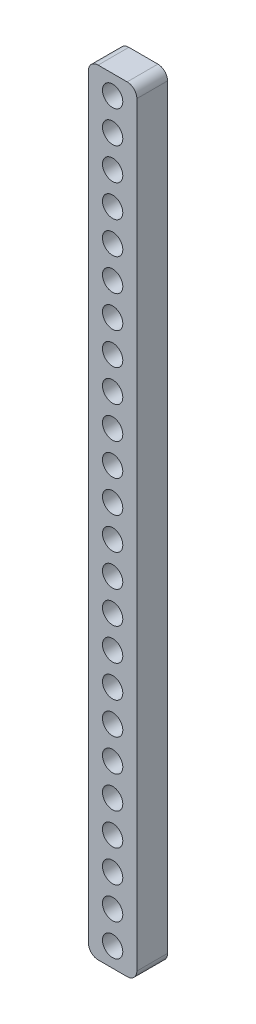
ISO-10303-21;
HEADER;
FILE_DESCRIPTION(('STEP AP214'),'2;1');
FILE_NAME('part.step','',(''),(''),'','','');
FILE_SCHEMA(('AUTOMOTIVE_DESIGN { 1 0 10303 214 1 1 1 1 }'));
ENDSEC;
DATA;
#1=APPLICATION_CONTEXT('core data for automotive mechanical design processes');
#2=APPLICATION_PROTOCOL_DEFINITION('international standard','automotive_design',2000,#1);
#3=PRODUCT_CONTEXT('',#1,'mechanical');
#4=PRODUCT('Part','Part','',(#3));
#5=PRODUCT_RELATED_PRODUCT_CATEGORY('part','',(#4));
#6=PRODUCT_DEFINITION_FORMATION('','',#4);
#7=PRODUCT_DEFINITION_CONTEXT('part definition',#1,'design');
#8=PRODUCT_DEFINITION('design','',#6,#7);
#9=PRODUCT_DEFINITION_SHAPE('','',#8);
#10=(LENGTH_UNIT() NAMED_UNIT(*) SI_UNIT(.MILLI.,.METRE.));
#11=(NAMED_UNIT(*) PLANE_ANGLE_UNIT() SI_UNIT($,.RADIAN.));
#12=(NAMED_UNIT(*) SI_UNIT($,.STERADIAN.) SOLID_ANGLE_UNIT());
#13=UNCERTAINTY_MEASURE_WITH_UNIT(LENGTH_MEASURE(1.E-05),#10,'distance_accuracy_value','');
#14=(GEOMETRIC_REPRESENTATION_CONTEXT(3) GLOBAL_UNCERTAINTY_ASSIGNED_CONTEXT((#13)) GLOBAL_UNIT_ASSIGNED_CONTEXT((#10,
#11,#12)) REPRESENTATION_CONTEXT('',''));
#15=CARTESIAN_POINT('',(0.,0.,0.));
#16=DIRECTION('',(0.,0.,1.));
#17=DIRECTION('',(1.,0.,0.));
#18=AXIS2_PLACEMENT_3D('',#15,#16,#17);
#19=CARTESIAN_POINT('',(-2.99999999999997,-78.,6.35));
#20=DIRECTION('',(0.,0.,-1.));
#21=DIRECTION('',(-1.,0.,0.));
#22=AXIS2_PLACEMENT_3D('',#19,#20,#21);
#23=PLANE('',#22);
#24=CARTESIAN_POINT('',(-2.99999999999997,-78.,6.35));
#25=DIRECTION('',(0.,0.,1.));
#26=DIRECTION('',(-1.,0.,0.));
#27=AXIS2_PLACEMENT_3D('',#24,#25,#26);
#28=CIRCLE('',#27,2.);
#29=CARTESIAN_POINT('',(-4.99999999999997,-78.,6.35));
#30=VERTEX_POINT('',#29);
#31=CARTESIAN_POINT('',(-2.99999999999996,-80.,6.35));
#32=VERTEX_POINT('',#31);
#33=EDGE_CURVE('E164',#30,#32,#28,.T.);
#34=ORIENTED_EDGE('',*,*,#33,.T.);
#35=DIRECTION('',(1.,0.,0.));
#36=VECTOR('',#35,1.);
#37=CARTESIAN_POINT('',(2.99999999999995,-80.,6.35));
#38=LINE('',#37,#36);
#39=CARTESIAN_POINT('',(2.99999999999995,-80.,6.35));
#40=VERTEX_POINT('',#39);
#41=EDGE_CURVE('E100',#32,#40,#38,.T.);
#42=ORIENTED_EDGE('',*,*,#41,.T.);
#43=CARTESIAN_POINT('',(2.99999999999997,-78.,6.35));
#44=DIRECTION('',(0.,0.,1.));
#45=DIRECTION('',(1.,0.,0.));
#46=AXIS2_PLACEMENT_3D('',#43,#44,#45);
#47=CIRCLE('',#46,2.);
#48=CARTESIAN_POINT('',(4.99999999999997,-78.,6.35));
#49=VERTEX_POINT('',#48);
#50=EDGE_CURVE('E185',#40,#49,#47,.T.);
#51=ORIENTED_EDGE('',*,*,#50,.T.);
#52=DIRECTION('',(0.,1.,0.));
#53=VECTOR('',#52,1.);
#54=CARTESIAN_POINT('',(4.99999999999997,-78.,6.35));
#55=LINE('',#54,#53);
#56=CARTESIAN_POINT('',(4.99999999999997,78.,6.35));
#57=VERTEX_POINT('',#56);
#58=EDGE_CURVE('E199',#49,#57,#55,.T.);
#59=ORIENTED_EDGE('',*,*,#58,.T.);
#60=CARTESIAN_POINT('',(2.99999999999997,78.,6.35));
#61=DIRECTION('',(0.,0.,1.));
#62=DIRECTION('',(1.,0.,0.));
#63=AXIS2_PLACEMENT_3D('',#60,#61,#62);
#64=CIRCLE('',#63,2.);
#65=CARTESIAN_POINT('',(2.99999999999996,80.,6.35));
#66=VERTEX_POINT('',#65);
#67=EDGE_CURVE('E119',#57,#66,#64,.T.);
#68=ORIENTED_EDGE('',*,*,#67,.T.);
#69=DIRECTION('',(-1.,0.,0.));
#70=VECTOR('',#69,1.);
#71=CARTESIAN_POINT('',(2.99999999999995,80.,6.35));
#72=LINE('',#71,#70);
#73=CARTESIAN_POINT('',(-3.00000000000002,80.,6.35));
#74=VERTEX_POINT('',#73);
#75=EDGE_CURVE('E113',#66,#74,#72,.T.);
#76=ORIENTED_EDGE('',*,*,#75,.T.);
#77=CARTESIAN_POINT('',(-3.00000000000003,78.,6.35));
#78=DIRECTION('',(0.,0.,1.));
#79=DIRECTION('',(1.,0.,0.));
#80=AXIS2_PLACEMENT_3D('',#77,#78,#79);
#81=CIRCLE('',#80,2.);
#82=CARTESIAN_POINT('',(-5.00000000000003,78.,6.35));
#83=VERTEX_POINT('',#82);
#84=EDGE_CURVE('E117',#74,#83,#81,.T.);
#85=ORIENTED_EDGE('',*,*,#84,.T.);
#86=DIRECTION('',(0.,-1.,0.));
#87=VECTOR('',#86,1.);
#88=CARTESIAN_POINT('',(-4.99999999999997,-78.,6.35));
#89=LINE('',#88,#87);
#90=EDGE_CURVE('E57',#83,#30,#89,.T.);
#91=ORIENTED_EDGE('',*,*,#90,.T.);
#92=EDGE_LOOP('',(#34,#42,#51,#59,#68,#76,#85,#91));
#93=FACE_BOUND('',#92,.T.);
#94=CARTESIAN_POINT('',(0.,76.,6.35));
#95=DIRECTION('',(0.,0.,1.));
#96=DIRECTION('',(1.,0.,0.));
#97=AXIS2_PLACEMENT_3D('',#94,#95,#96);
#98=CIRCLE('',#97,2.09999999999985);
#99=CARTESIAN_POINT('',(2.09999999999985,76.,6.35));
#100=VERTEX_POINT('',#99);
#101=EDGE_CURVE('E146',#100,#100,#98,.T.);
#102=ORIENTED_EDGE('',*,*,#101,.F.);
#103=EDGE_LOOP('',(#102));
#104=FACE_BOUND('',#103,.T.);
#105=CARTESIAN_POINT('',(0.,69.3913043478261,6.35));
#106=DIRECTION('',(0.,0.,1.));
#107=DIRECTION('',(1.,0.,0.));
#108=AXIS2_PLACEMENT_3D('',#105,#106,#107);
#109=CIRCLE('',#108,2.10000000000001);
#110=CARTESIAN_POINT('',(2.10000000000008,69.3913043478261,6.35));
#111=VERTEX_POINT('',#110);
#112=EDGE_CURVE('E213',#111,#111,#109,.T.);
#113=ORIENTED_EDGE('',*,*,#112,.F.);
#114=EDGE_LOOP('',(#113));
#115=FACE_BOUND('',#114,.T.);
#116=CARTESIAN_POINT('',(1.37635493464256E-13,62.7826086956522,6.35));
#117=DIRECTION('',(0.,0.,1.));
#118=DIRECTION('',(1.,0.,0.));
#119=AXIS2_PLACEMENT_3D('',#116,#117,#118);
#120=CIRCLE('',#119,2.10000000000001);
#121=CARTESIAN_POINT('',(2.10000000000014,62.7826086956522,6.35));
#122=VERTEX_POINT('',#121);
#123=EDGE_CURVE('E221',#122,#122,#120,.T.);
#124=ORIENTED_EDGE('',*,*,#123,.F.);
#125=EDGE_LOOP('',(#124));
#126=FACE_BOUND('',#125,.T.);
#127=CARTESIAN_POINT('',(2.06453240196385E-13,56.1739130434783,6.35));
#128=DIRECTION('',(0.,0.,1.));
#129=DIRECTION('',(1.,0.,0.));
#130=AXIS2_PLACEMENT_3D('',#127,#128,#129);
#131=CIRCLE('',#130,2.10000000000001);
#132=CARTESIAN_POINT('',(2.10000000000021,56.1739130434783,6.35));
#133=VERTEX_POINT('',#132);
#134=EDGE_CURVE('E229',#133,#133,#131,.T.);
#135=ORIENTED_EDGE('',*,*,#134,.F.);
#136=EDGE_LOOP('',(#135));
#137=FACE_BOUND('',#136,.T.);
#138=CARTESIAN_POINT('',(2.75270986928513E-13,49.5652173913043,6.35));
#139=DIRECTION('',(0.,0.,1.));
#140=DIRECTION('',(1.,0.,0.));
#141=AXIS2_PLACEMENT_3D('',#138,#139,#140);
#142=CIRCLE('',#141,2.10000000000001);
#143=CARTESIAN_POINT('',(2.10000000000028,49.5652173913043,6.35));
#144=VERTEX_POINT('',#143);
#145=EDGE_CURVE('E237',#144,#144,#142,.T.);
#146=ORIENTED_EDGE('',*,*,#145,.F.);
#147=EDGE_LOOP('',(#146));
#148=FACE_BOUND('',#147,.T.);
#149=CARTESIAN_POINT('',(3.44088733660641E-13,42.9565217391304,6.35));
#150=DIRECTION('',(0.,0.,1.));
#151=DIRECTION('',(1.,0.,0.));
#152=AXIS2_PLACEMENT_3D('',#149,#150,#151);
#153=CIRCLE('',#152,2.10000000000001);
#154=CARTESIAN_POINT('',(2.10000000000035,42.9565217391304,6.35));
#155=VERTEX_POINT('',#154);
#156=EDGE_CURVE('E245',#155,#155,#153,.T.);
#157=ORIENTED_EDGE('',*,*,#156,.F.);
#158=EDGE_LOOP('',(#157));
#159=FACE_BOUND('',#158,.T.);
#160=CARTESIAN_POINT('',(4.12906480392769E-13,36.3478260869565,6.35));
#161=DIRECTION('',(0.,0.,1.));
#162=DIRECTION('',(1.,0.,0.));
#163=AXIS2_PLACEMENT_3D('',#160,#161,#162);
#164=CIRCLE('',#163,2.10000000000001);
#165=CARTESIAN_POINT('',(2.10000000000042,36.3478260869565,6.35));
#166=VERTEX_POINT('',#165);
#167=EDGE_CURVE('E253',#166,#166,#164,.T.);
#168=ORIENTED_EDGE('',*,*,#167,.F.);
#169=EDGE_LOOP('',(#168));
#170=FACE_BOUND('',#169,.T.);
#171=CARTESIAN_POINT('',(4.81724227124897E-13,29.7391304347826,6.35));
#172=DIRECTION('',(0.,0.,1.));
#173=DIRECTION('',(1.,0.,0.));
#174=AXIS2_PLACEMENT_3D('',#171,#172,#173);
#175=CIRCLE('',#174,2.10000000000001);
#176=CARTESIAN_POINT('',(2.10000000000049,29.7391304347826,6.35));
#177=VERTEX_POINT('',#176);
#178=EDGE_CURVE('E261',#177,#177,#175,.T.);
#179=ORIENTED_EDGE('',*,*,#178,.F.);
#180=EDGE_LOOP('',(#179));
#181=FACE_BOUND('',#180,.T.);
#182=CARTESIAN_POINT('',(5.50541973857026E-13,23.1304347826087,6.35));
#183=DIRECTION('',(0.,0.,1.));
#184=DIRECTION('',(1.,0.,0.));
#185=AXIS2_PLACEMENT_3D('',#182,#183,#184);
#186=CIRCLE('',#185,2.1);
#187=CARTESIAN_POINT('',(2.10000000000056,23.1304347826087,6.35));
#188=VERTEX_POINT('',#187);
#189=EDGE_CURVE('E269',#188,#188,#186,.T.);
#190=ORIENTED_EDGE('',*,*,#189,.F.);
#191=EDGE_LOOP('',(#190));
#192=FACE_BOUND('',#191,.T.);
#193=CARTESIAN_POINT('',(6.19359720589154E-13,16.5217391304348,6.35));
#194=DIRECTION('',(0.,0.,1.));
#195=DIRECTION('',(1.,0.,0.));
#196=AXIS2_PLACEMENT_3D('',#193,#194,#195);
#197=CIRCLE('',#196,2.1);
#198=CARTESIAN_POINT('',(2.10000000000062,16.5217391304348,6.35));
#199=VERTEX_POINT('',#198);
#200=EDGE_CURVE('E277',#199,#199,#197,.T.);
#201=ORIENTED_EDGE('',*,*,#200,.F.);
#202=EDGE_LOOP('',(#201));
#203=FACE_BOUND('',#202,.T.);
#204=CARTESIAN_POINT('',(6.88177467321282E-13,9.91304347826087,6.35));
#205=DIRECTION('',(0.,0.,1.));
#206=DIRECTION('',(1.,0.,0.));
#207=AXIS2_PLACEMENT_3D('',#204,#205,#206);
#208=CIRCLE('',#207,2.1);
#209=CARTESIAN_POINT('',(2.10000000000069,9.91304347826087,6.35));
#210=VERTEX_POINT('',#209);
#211=EDGE_CURVE('E285',#210,#210,#208,.T.);
#212=ORIENTED_EDGE('',*,*,#211,.F.);
#213=EDGE_LOOP('',(#212));
#214=FACE_BOUND('',#213,.T.);
#215=CARTESIAN_POINT('',(7.5699521405341E-13,3.30434782608696,6.35));
#216=DIRECTION('',(0.,0.,1.));
#217=DIRECTION('',(1.,0.,0.));
#218=AXIS2_PLACEMENT_3D('',#215,#216,#217);
#219=CIRCLE('',#218,2.1);
#220=CARTESIAN_POINT('',(2.10000000000076,3.30434782608696,6.35));
#221=VERTEX_POINT('',#220);
#222=EDGE_CURVE('E293',#221,#221,#219,.T.);
#223=ORIENTED_EDGE('',*,*,#222,.F.);
#224=EDGE_LOOP('',(#223));
#225=FACE_BOUND('',#224,.T.);
#226=CARTESIAN_POINT('',(8.25812960785539E-13,-3.30434782608695,6.35));
#227=DIRECTION('',(0.,0.,1.));
#228=DIRECTION('',(1.,0.,0.));
#229=AXIS2_PLACEMENT_3D('',#226,#227,#228);
#230=CIRCLE('',#229,2.1);
#231=CARTESIAN_POINT('',(2.10000000000083,-3.30434782608695,6.35));
#232=VERTEX_POINT('',#231);
#233=EDGE_CURVE('E301',#232,#232,#230,.T.);
#234=ORIENTED_EDGE('',*,*,#233,.F.);
#235=EDGE_LOOP('',(#234));
#236=FACE_BOUND('',#235,.T.);
#237=CARTESIAN_POINT('',(8.94630707517667E-13,-9.91304347826086,6.35));
#238=DIRECTION('',(0.,0.,1.));
#239=DIRECTION('',(1.,0.,0.));
#240=AXIS2_PLACEMENT_3D('',#237,#238,#239);
#241=CIRCLE('',#240,2.1);
#242=CARTESIAN_POINT('',(2.1000000000009,-9.91304347826086,6.35));
#243=VERTEX_POINT('',#242);
#244=EDGE_CURVE('E309',#243,#243,#241,.T.);
#245=ORIENTED_EDGE('',*,*,#244,.F.);
#246=EDGE_LOOP('',(#245));
#247=FACE_BOUND('',#246,.T.);
#248=CARTESIAN_POINT('',(9.63448454249795E-13,-16.5217391304348,6.35));
#249=DIRECTION('',(0.,0.,1.));
#250=DIRECTION('',(1.,0.,0.));
#251=AXIS2_PLACEMENT_3D('',#248,#249,#250);
#252=CIRCLE('',#251,2.1);
#253=CARTESIAN_POINT('',(2.10000000000097,-16.5217391304348,6.35));
#254=VERTEX_POINT('',#253);
#255=EDGE_CURVE('E317',#254,#254,#252,.T.);
#256=ORIENTED_EDGE('',*,*,#255,.F.);
#257=EDGE_LOOP('',(#256));
#258=FACE_BOUND('',#257,.T.);
#259=CARTESIAN_POINT('',(1.03226620098192E-12,-23.1304347826087,6.35));
#260=DIRECTION('',(0.,0.,1.));
#261=DIRECTION('',(1.,0.,0.));
#262=AXIS2_PLACEMENT_3D('',#259,#260,#261);
#263=CIRCLE('',#262,2.1);
#264=CARTESIAN_POINT('',(2.10000000000104,-23.1304347826087,6.35));
#265=VERTEX_POINT('',#264);
#266=EDGE_CURVE('E325',#265,#265,#263,.T.);
#267=ORIENTED_EDGE('',*,*,#266,.F.);
#268=EDGE_LOOP('',(#267));
#269=FACE_BOUND('',#268,.T.);
#270=CARTESIAN_POINT('',(1.10108394771405E-12,-29.7391304347826,6.35));
#271=DIRECTION('',(0.,0.,1.));
#272=DIRECTION('',(1.,0.,0.));
#273=AXIS2_PLACEMENT_3D('',#270,#271,#272);
#274=CIRCLE('',#273,2.1);
#275=CARTESIAN_POINT('',(2.10000000000111,-29.7391304347826,6.35));
#276=VERTEX_POINT('',#275);
#277=EDGE_CURVE('E333',#276,#276,#274,.T.);
#278=ORIENTED_EDGE('',*,*,#277,.F.);
#279=EDGE_LOOP('',(#278));
#280=FACE_BOUND('',#279,.T.);
#281=CARTESIAN_POINT('',(1.16990169444618E-12,-36.3478260869565,6.35));
#282=DIRECTION('',(0.,0.,1.));
#283=DIRECTION('',(1.,0.,0.));
#284=AXIS2_PLACEMENT_3D('',#281,#282,#283);
#285=CIRCLE('',#284,2.10000000000001);
#286=CARTESIAN_POINT('',(2.10000000000118,-36.3478260869565,6.35));
#287=VERTEX_POINT('',#286);
#288=EDGE_CURVE('E341',#287,#287,#285,.T.);
#289=ORIENTED_EDGE('',*,*,#288,.F.);
#290=EDGE_LOOP('',(#289));
#291=FACE_BOUND('',#290,.T.);
#292=CARTESIAN_POINT('',(1.23871944117831E-12,-42.9565217391304,6.35));
#293=DIRECTION('',(0.,0.,1.));
#294=DIRECTION('',(1.,0.,0.));
#295=AXIS2_PLACEMENT_3D('',#292,#293,#294);
#296=CIRCLE('',#295,2.10000000000001);
#297=CARTESIAN_POINT('',(2.10000000000125,-42.9565217391304,6.35));
#298=VERTEX_POINT('',#297);
#299=EDGE_CURVE('E349',#298,#298,#296,.T.);
#300=ORIENTED_EDGE('',*,*,#299,.F.);
#301=EDGE_LOOP('',(#300));
#302=FACE_BOUND('',#301,.T.);
#303=CARTESIAN_POINT('',(1.30753718791044E-12,-49.5652173913043,6.35));
#304=DIRECTION('',(0.,0.,1.));
#305=DIRECTION('',(1.,0.,0.));
#306=AXIS2_PLACEMENT_3D('',#303,#304,#305);
#307=CIRCLE('',#306,2.10000000000001);
#308=CARTESIAN_POINT('',(2.10000000000131,-49.5652173913043,6.35));
#309=VERTEX_POINT('',#308);
#310=EDGE_CURVE('E357',#309,#309,#307,.T.);
#311=ORIENTED_EDGE('',*,*,#310,.F.);
#312=EDGE_LOOP('',(#311));
#313=FACE_BOUND('',#312,.T.);
#314=CARTESIAN_POINT('',(1.37635493464256E-12,-56.1739130434783,6.35));
#315=DIRECTION('',(0.,0.,1.));
#316=DIRECTION('',(1.,0.,0.));
#317=AXIS2_PLACEMENT_3D('',#314,#315,#316);
#318=CIRCLE('',#317,2.10000000000001);
#319=CARTESIAN_POINT('',(2.10000000000138,-56.1739130434783,6.35));
#320=VERTEX_POINT('',#319);
#321=EDGE_CURVE('E365',#320,#320,#318,.T.);
#322=ORIENTED_EDGE('',*,*,#321,.F.);
#323=EDGE_LOOP('',(#322));
#324=FACE_BOUND('',#323,.T.);
#325=CARTESIAN_POINT('',(1.44517268137469E-12,-62.7826086956522,6.35));
#326=DIRECTION('',(0.,0.,1.));
#327=DIRECTION('',(1.,0.,0.));
#328=AXIS2_PLACEMENT_3D('',#325,#326,#327);
#329=CIRCLE('',#328,2.10000000000001);
#330=CARTESIAN_POINT('',(2.10000000000145,-62.7826086956522,6.35));
#331=VERTEX_POINT('',#330);
#332=EDGE_CURVE('E373',#331,#331,#329,.T.);
#333=ORIENTED_EDGE('',*,*,#332,.F.);
#334=EDGE_LOOP('',(#333));
#335=FACE_BOUND('',#334,.T.);
#336=CARTESIAN_POINT('',(1.51399042810682E-12,-69.3913043478261,6.35));
#337=DIRECTION('',(0.,0.,1.));
#338=DIRECTION('',(1.,0.,0.));
#339=AXIS2_PLACEMENT_3D('',#336,#337,#338);
#340=CIRCLE('',#339,2.10000000000001);
#341=CARTESIAN_POINT('',(2.10000000000152,-69.3913043478261,6.35));
#342=VERTEX_POINT('',#341);
#343=EDGE_CURVE('E381',#342,#342,#340,.T.);
#344=ORIENTED_EDGE('',*,*,#343,.F.);
#345=EDGE_LOOP('',(#344));
#346=FACE_BOUND('',#345,.T.);
#347=CARTESIAN_POINT('',(1.54993306909482E-12,-76.,6.35));
#348=DIRECTION('',(0.,0.,1.));
#349=DIRECTION('',(1.,0.,0.));
#350=AXIS2_PLACEMENT_3D('',#347,#348,#349);
#351=CIRCLE('',#350,2.10000000000001);
#352=CARTESIAN_POINT('',(2.10000000000156,-76.,6.35));
#353=VERTEX_POINT('',#352);
#354=EDGE_CURVE('E389',#353,#353,#351,.T.);
#355=ORIENTED_EDGE('',*,*,#354,.F.);
#356=EDGE_LOOP('',(#355));
#357=FACE_BOUND('',#356,.T.);
#358=ADVANCED_FACE('F39',(#93,#104,#115,#126,#137,#148,#159,#170,#181,#192,#203,#214,#225,#236,
#247,#258,#269,#280,#291,#302,#313,#324,#335,#346,#357),#23,.F.);
#359=CARTESIAN_POINT('',(-2.99999999999997,-78.,0.));
#360=DIRECTION('',(0.,0.,-1.));
#361=DIRECTION('',(-1.,0.,0.));
#362=AXIS2_PLACEMENT_3D('',#359,#360,#361);
#363=PLANE('',#362);
#364=CARTESIAN_POINT('',(1.51399042810682E-12,-69.3913043478261,0.));
#365=DIRECTION('',(0.,0.,1.));
#366=DIRECTION('',(1.,0.,0.));
#367=AXIS2_PLACEMENT_3D('',#364,#365,#366);
#368=CIRCLE('',#367,2.10000000000001);
#369=CARTESIAN_POINT('',(2.10000000000152,-69.3913043478261,0.));
#370=VERTEX_POINT('',#369);
#371=EDGE_CURVE('E385',#370,#370,#368,.T.);
#372=ORIENTED_EDGE('',*,*,#371,.T.);
#373=EDGE_LOOP('',(#372));
#374=FACE_BOUND('',#373,.T.);
#375=CARTESIAN_POINT('',(1.37635493464256E-12,-56.1739130434783,0.));
#376=DIRECTION('',(0.,0.,1.));
#377=DIRECTION('',(1.,0.,0.));
#378=AXIS2_PLACEMENT_3D('',#375,#376,#377);
#379=CIRCLE('',#378,2.10000000000001);
#380=CARTESIAN_POINT('',(2.10000000000138,-56.1739130434783,0.));
#381=VERTEX_POINT('',#380);
#382=EDGE_CURVE('E369',#381,#381,#379,.T.);
#383=ORIENTED_EDGE('',*,*,#382,.T.);
#384=EDGE_LOOP('',(#383));
#385=FACE_BOUND('',#384,.T.);
#386=CARTESIAN_POINT('',(1.23871944117831E-12,-42.9565217391304,0.));
#387=DIRECTION('',(0.,0.,1.));
#388=DIRECTION('',(1.,0.,0.));
#389=AXIS2_PLACEMENT_3D('',#386,#387,#388);
#390=CIRCLE('',#389,2.10000000000001);
#391=CARTESIAN_POINT('',(2.10000000000125,-42.9565217391304,0.));
#392=VERTEX_POINT('',#391);
#393=EDGE_CURVE('E353',#392,#392,#390,.T.);
#394=ORIENTED_EDGE('',*,*,#393,.T.);
#395=EDGE_LOOP('',(#394));
#396=FACE_BOUND('',#395,.T.);
#397=CARTESIAN_POINT('',(1.10108394771405E-12,-29.7391304347826,0.));
#398=DIRECTION('',(0.,0.,1.));
#399=DIRECTION('',(1.,0.,0.));
#400=AXIS2_PLACEMENT_3D('',#397,#398,#399);
#401=CIRCLE('',#400,2.1);
#402=CARTESIAN_POINT('',(2.10000000000111,-29.7391304347826,0.));
#403=VERTEX_POINT('',#402);
#404=EDGE_CURVE('E337',#403,#403,#401,.T.);
#405=ORIENTED_EDGE('',*,*,#404,.T.);
#406=EDGE_LOOP('',(#405));
#407=FACE_BOUND('',#406,.T.);
#408=CARTESIAN_POINT('',(9.63448454249795E-13,-16.5217391304348,0.));
#409=DIRECTION('',(0.,0.,1.));
#410=DIRECTION('',(1.,0.,0.));
#411=AXIS2_PLACEMENT_3D('',#408,#409,#410);
#412=CIRCLE('',#411,2.1);
#413=CARTESIAN_POINT('',(2.10000000000097,-16.5217391304348,0.));
#414=VERTEX_POINT('',#413);
#415=EDGE_CURVE('E321',#414,#414,#412,.T.);
#416=ORIENTED_EDGE('',*,*,#415,.T.);
#417=EDGE_LOOP('',(#416));
#418=FACE_BOUND('',#417,.T.);
#419=CARTESIAN_POINT('',(8.25812960785539E-13,-3.30434782608695,0.));
#420=DIRECTION('',(0.,0.,1.));
#421=DIRECTION('',(1.,0.,0.));
#422=AXIS2_PLACEMENT_3D('',#419,#420,#421);
#423=CIRCLE('',#422,2.1);
#424=CARTESIAN_POINT('',(2.10000000000083,-3.30434782608695,0.));
#425=VERTEX_POINT('',#424);
#426=EDGE_CURVE('E305',#425,#425,#423,.T.);
#427=ORIENTED_EDGE('',*,*,#426,.T.);
#428=EDGE_LOOP('',(#427));
#429=FACE_BOUND('',#428,.T.);
#430=CARTESIAN_POINT('',(6.88177467321282E-13,9.91304347826087,0.));
#431=DIRECTION('',(0.,0.,1.));
#432=DIRECTION('',(1.,0.,0.));
#433=AXIS2_PLACEMENT_3D('',#430,#431,#432);
#434=CIRCLE('',#433,2.1);
#435=CARTESIAN_POINT('',(2.10000000000069,9.91304347826087,0.));
#436=VERTEX_POINT('',#435);
#437=EDGE_CURVE('E289',#436,#436,#434,.T.);
#438=ORIENTED_EDGE('',*,*,#437,.T.);
#439=EDGE_LOOP('',(#438));
#440=FACE_BOUND('',#439,.T.);
#441=CARTESIAN_POINT('',(5.50541973857026E-13,23.1304347826087,0.));
#442=DIRECTION('',(0.,0.,1.));
#443=DIRECTION('',(1.,0.,0.));
#444=AXIS2_PLACEMENT_3D('',#441,#442,#443);
#445=CIRCLE('',#444,2.1);
#446=CARTESIAN_POINT('',(2.10000000000056,23.1304347826087,0.));
#447=VERTEX_POINT('',#446);
#448=EDGE_CURVE('E273',#447,#447,#445,.T.);
#449=ORIENTED_EDGE('',*,*,#448,.T.);
#450=EDGE_LOOP('',(#449));
#451=FACE_BOUND('',#450,.T.);
#452=CARTESIAN_POINT('',(4.12906480392769E-13,36.3478260869565,0.));
#453=DIRECTION('',(0.,0.,1.));
#454=DIRECTION('',(1.,0.,0.));
#455=AXIS2_PLACEMENT_3D('',#452,#453,#454);
#456=CIRCLE('',#455,2.10000000000001);
#457=CARTESIAN_POINT('',(2.10000000000042,36.3478260869565,0.));
#458=VERTEX_POINT('',#457);
#459=EDGE_CURVE('E257',#458,#458,#456,.T.);
#460=ORIENTED_EDGE('',*,*,#459,.T.);
#461=EDGE_LOOP('',(#460));
#462=FACE_BOUND('',#461,.T.);
#463=CARTESIAN_POINT('',(2.75270986928513E-13,49.5652173913043,0.));
#464=DIRECTION('',(0.,0.,1.));
#465=DIRECTION('',(1.,0.,0.));
#466=AXIS2_PLACEMENT_3D('',#463,#464,#465);
#467=CIRCLE('',#466,2.10000000000001);
#468=CARTESIAN_POINT('',(2.10000000000028,49.5652173913043,0.));
#469=VERTEX_POINT('',#468);
#470=EDGE_CURVE('E241',#469,#469,#467,.T.);
#471=ORIENTED_EDGE('',*,*,#470,.T.);
#472=EDGE_LOOP('',(#471));
#473=FACE_BOUND('',#472,.T.);
#474=CARTESIAN_POINT('',(1.37635493464256E-13,62.7826086956522,0.));
#475=DIRECTION('',(0.,0.,1.));
#476=DIRECTION('',(1.,0.,0.));
#477=AXIS2_PLACEMENT_3D('',#474,#475,#476);
#478=CIRCLE('',#477,2.10000000000001);
#479=CARTESIAN_POINT('',(2.10000000000014,62.7826086956522,0.));
#480=VERTEX_POINT('',#479);
#481=EDGE_CURVE('E225',#480,#480,#478,.T.);
#482=ORIENTED_EDGE('',*,*,#481,.T.);
#483=EDGE_LOOP('',(#482));
#484=FACE_BOUND('',#483,.T.);
#485=CARTESIAN_POINT('',(0.,76.,0.));
#486=DIRECTION('',(0.,0.,1.));
#487=DIRECTION('',(1.,0.,0.));
#488=AXIS2_PLACEMENT_3D('',#485,#486,#487);
#489=CIRCLE('',#488,2.09999999999985);
#490=CARTESIAN_POINT('',(2.09999999999985,76.,0.));
#491=VERTEX_POINT('',#490);
#492=EDGE_CURVE('E209',#491,#491,#489,.T.);
#493=ORIENTED_EDGE('',*,*,#492,.T.);
#494=EDGE_LOOP('',(#493));
#495=FACE_BOUND('',#494,.T.);
#496=CARTESIAN_POINT('',(-2.99999999999997,-78.,0.));
#497=DIRECTION('',(0.,0.,1.));
#498=DIRECTION('',(-1.,0.,0.));
#499=AXIS2_PLACEMENT_3D('',#496,#497,#498);
#500=CIRCLE('',#499,2.);
#501=CARTESIAN_POINT('',(-4.99999999999997,-78.,0.));
#502=VERTEX_POINT('',#501);
#503=CARTESIAN_POINT('',(-2.99999999999996,-80.,0.));
#504=VERTEX_POINT('',#503);
#505=EDGE_CURVE('E141',#502,#504,#500,.T.);
#506=ORIENTED_EDGE('',*,*,#505,.F.);
#507=DIRECTION('',(0.,-1.,0.));
#508=VECTOR('',#507,1.);
#509=CARTESIAN_POINT('',(-4.99999999999997,-78.,0.));
#510=LINE('',#509,#508);
#511=CARTESIAN_POINT('',(-5.00000000000003,78.,0.));
#512=VERTEX_POINT('',#511);
#513=EDGE_CURVE('E92',#512,#502,#510,.T.);
#514=ORIENTED_EDGE('',*,*,#513,.F.);
#515=CARTESIAN_POINT('',(-3.00000000000003,78.,0.));
#516=DIRECTION('',(0.,0.,1.));
#517=DIRECTION('',(1.,0.,0.));
#518=AXIS2_PLACEMENT_3D('',#515,#516,#517);
#519=CIRCLE('',#518,2.);
#520=CARTESIAN_POINT('',(-3.00000000000002,80.,0.));
#521=VERTEX_POINT('',#520);
#522=EDGE_CURVE('E86',#521,#512,#519,.T.);
#523=ORIENTED_EDGE('',*,*,#522,.F.);
#524=DIRECTION('',(-1.,0.,0.));
#525=VECTOR('',#524,1.);
#526=CARTESIAN_POINT('',(2.99999999999995,80.,0.));
#527=LINE('',#526,#525);
#528=CARTESIAN_POINT('',(2.99999999999996,80.,0.));
#529=VERTEX_POINT('',#528);
#530=EDGE_CURVE('E128',#529,#521,#527,.T.);
#531=ORIENTED_EDGE('',*,*,#530,.F.);
#532=CARTESIAN_POINT('',(2.99999999999997,78.,0.));
#533=DIRECTION('',(0.,0.,1.));
#534=DIRECTION('',(1.,0.,0.));
#535=AXIS2_PLACEMENT_3D('',#532,#533,#534);
#536=CIRCLE('',#535,2.);
#537=CARTESIAN_POINT('',(4.99999999999997,78.,0.));
#538=VERTEX_POINT('',#537);
#539=EDGE_CURVE('E155',#538,#529,#536,.T.);
#540=ORIENTED_EDGE('',*,*,#539,.F.);
#541=DIRECTION('',(0.,1.,0.));
#542=VECTOR('',#541,1.);
#543=CARTESIAN_POINT('',(4.99999999999997,-78.,0.));
#544=LINE('',#543,#542);
#545=CARTESIAN_POINT('',(4.99999999999997,-78.,0.));
#546=VERTEX_POINT('',#545);
#547=EDGE_CURVE('E152',#546,#538,#544,.T.);
#548=ORIENTED_EDGE('',*,*,#547,.F.);
#549=CARTESIAN_POINT('',(2.99999999999997,-78.,0.));
#550=DIRECTION('',(0.,0.,1.));
#551=DIRECTION('',(1.,0.,0.));
#552=AXIS2_PLACEMENT_3D('',#549,#550,#551);
#553=CIRCLE('',#552,2.);
#554=CARTESIAN_POINT('',(2.99999999999995,-80.,0.));
#555=VERTEX_POINT('',#554);
#556=EDGE_CURVE('E149',#555,#546,#553,.T.);
#557=ORIENTED_EDGE('',*,*,#556,.F.);
#558=DIRECTION('',(1.,0.,0.));
#559=VECTOR('',#558,1.);
#560=CARTESIAN_POINT('',(2.99999999999995,-80.,0.));
#561=LINE('',#560,#559);
#562=EDGE_CURVE('E145',#504,#555,#561,.T.);
#563=ORIENTED_EDGE('',*,*,#562,.F.);
#564=EDGE_LOOP('',(#506,#514,#523,#531,#540,#548,#557,#563));
#565=FACE_BOUND('',#564,.T.);
#566=CARTESIAN_POINT('',(0.,69.3913043478261,0.));
#567=DIRECTION('',(0.,0.,1.));
#568=DIRECTION('',(1.,0.,0.));
#569=AXIS2_PLACEMENT_3D('',#566,#567,#568);
#570=CIRCLE('',#569,2.10000000000001);
#571=CARTESIAN_POINT('',(2.10000000000008,69.3913043478261,0.));
#572=VERTEX_POINT('',#571);
#573=EDGE_CURVE('E217',#572,#572,#570,.T.);
#574=ORIENTED_EDGE('',*,*,#573,.T.);
#575=EDGE_LOOP('',(#574));
#576=FACE_BOUND('',#575,.T.);
#577=CARTESIAN_POINT('',(2.06453240196385E-13,56.1739130434783,0.));
#578=DIRECTION('',(0.,0.,1.));
#579=DIRECTION('',(1.,0.,0.));
#580=AXIS2_PLACEMENT_3D('',#577,#578,#579);
#581=CIRCLE('',#580,2.10000000000001);
#582=CARTESIAN_POINT('',(2.10000000000021,56.1739130434783,0.));
#583=VERTEX_POINT('',#582);
#584=EDGE_CURVE('E233',#583,#583,#581,.T.);
#585=ORIENTED_EDGE('',*,*,#584,.T.);
#586=EDGE_LOOP('',(#585));
#587=FACE_BOUND('',#586,.T.);
#588=CARTESIAN_POINT('',(3.44088733660641E-13,42.9565217391304,0.));
#589=DIRECTION('',(0.,0.,1.));
#590=DIRECTION('',(1.,0.,0.));
#591=AXIS2_PLACEMENT_3D('',#588,#589,#590);
#592=CIRCLE('',#591,2.10000000000001);
#593=CARTESIAN_POINT('',(2.10000000000035,42.9565217391304,0.));
#594=VERTEX_POINT('',#593);
#595=EDGE_CURVE('E249',#594,#594,#592,.T.);
#596=ORIENTED_EDGE('',*,*,#595,.T.);
#597=EDGE_LOOP('',(#596));
#598=FACE_BOUND('',#597,.T.);
#599=CARTESIAN_POINT('',(4.81724227124897E-13,29.7391304347826,0.));
#600=DIRECTION('',(0.,0.,1.));
#601=DIRECTION('',(1.,0.,0.));
#602=AXIS2_PLACEMENT_3D('',#599,#600,#601);
#603=CIRCLE('',#602,2.10000000000001);
#604=CARTESIAN_POINT('',(2.10000000000049,29.7391304347826,0.));
#605=VERTEX_POINT('',#604);
#606=EDGE_CURVE('E265',#605,#605,#603,.T.);
#607=ORIENTED_EDGE('',*,*,#606,.T.);
#608=EDGE_LOOP('',(#607));
#609=FACE_BOUND('',#608,.T.);
#610=CARTESIAN_POINT('',(6.19359720589154E-13,16.5217391304348,0.));
#611=DIRECTION('',(0.,0.,1.));
#612=DIRECTION('',(1.,0.,0.));
#613=AXIS2_PLACEMENT_3D('',#610,#611,#612);
#614=CIRCLE('',#613,2.1);
#615=CARTESIAN_POINT('',(2.10000000000062,16.5217391304348,0.));
#616=VERTEX_POINT('',#615);
#617=EDGE_CURVE('E281',#616,#616,#614,.T.);
#618=ORIENTED_EDGE('',*,*,#617,.T.);
#619=EDGE_LOOP('',(#618));
#620=FACE_BOUND('',#619,.T.);
#621=CARTESIAN_POINT('',(7.5699521405341E-13,3.30434782608696,0.));
#622=DIRECTION('',(0.,0.,1.));
#623=DIRECTION('',(1.,0.,0.));
#624=AXIS2_PLACEMENT_3D('',#621,#622,#623);
#625=CIRCLE('',#624,2.1);
#626=CARTESIAN_POINT('',(2.10000000000076,3.30434782608696,0.));
#627=VERTEX_POINT('',#626);
#628=EDGE_CURVE('E297',#627,#627,#625,.T.);
#629=ORIENTED_EDGE('',*,*,#628,.T.);
#630=EDGE_LOOP('',(#629));
#631=FACE_BOUND('',#630,.T.);
#632=CARTESIAN_POINT('',(8.94630707517667E-13,-9.91304347826086,0.));
#633=DIRECTION('',(0.,0.,1.));
#634=DIRECTION('',(1.,0.,0.));
#635=AXIS2_PLACEMENT_3D('',#632,#633,#634);
#636=CIRCLE('',#635,2.1);
#637=CARTESIAN_POINT('',(2.1000000000009,-9.91304347826086,0.));
#638=VERTEX_POINT('',#637);
#639=EDGE_CURVE('E313',#638,#638,#636,.T.);
#640=ORIENTED_EDGE('',*,*,#639,.T.);
#641=EDGE_LOOP('',(#640));
#642=FACE_BOUND('',#641,.T.);
#643=CARTESIAN_POINT('',(1.03226620098192E-12,-23.1304347826087,0.));
#644=DIRECTION('',(0.,0.,1.));
#645=DIRECTION('',(1.,0.,0.));
#646=AXIS2_PLACEMENT_3D('',#643,#644,#645);
#647=CIRCLE('',#646,2.1);
#648=CARTESIAN_POINT('',(2.10000000000104,-23.1304347826087,0.));
#649=VERTEX_POINT('',#648);
#650=EDGE_CURVE('E329',#649,#649,#647,.T.);
#651=ORIENTED_EDGE('',*,*,#650,.T.);
#652=EDGE_LOOP('',(#651));
#653=FACE_BOUND('',#652,.T.);
#654=CARTESIAN_POINT('',(1.16990169444618E-12,-36.3478260869565,0.));
#655=DIRECTION('',(0.,0.,1.));
#656=DIRECTION('',(1.,0.,0.));
#657=AXIS2_PLACEMENT_3D('',#654,#655,#656);
#658=CIRCLE('',#657,2.10000000000001);
#659=CARTESIAN_POINT('',(2.10000000000118,-36.3478260869565,0.));
#660=VERTEX_POINT('',#659);
#661=EDGE_CURVE('E345',#660,#660,#658,.T.);
#662=ORIENTED_EDGE('',*,*,#661,.T.);
#663=EDGE_LOOP('',(#662));
#664=FACE_BOUND('',#663,.T.);
#665=CARTESIAN_POINT('',(1.30753718791044E-12,-49.5652173913043,0.));
#666=DIRECTION('',(0.,0.,1.));
#667=DIRECTION('',(1.,0.,0.));
#668=AXIS2_PLACEMENT_3D('',#665,#666,#667);
#669=CIRCLE('',#668,2.10000000000001);
#670=CARTESIAN_POINT('',(2.10000000000131,-49.5652173913043,0.));
#671=VERTEX_POINT('',#670);
#672=EDGE_CURVE('E361',#671,#671,#669,.T.);
#673=ORIENTED_EDGE('',*,*,#672,.T.);
#674=EDGE_LOOP('',(#673));
#675=FACE_BOUND('',#674,.T.);
#676=CARTESIAN_POINT('',(1.44517268137469E-12,-62.7826086956522,0.));
#677=DIRECTION('',(0.,0.,1.));
#678=DIRECTION('',(1.,0.,0.));
#679=AXIS2_PLACEMENT_3D('',#676,#677,#678);
#680=CIRCLE('',#679,2.10000000000001);
#681=CARTESIAN_POINT('',(2.10000000000145,-62.7826086956522,0.));
#682=VERTEX_POINT('',#681);
#683=EDGE_CURVE('E377',#682,#682,#680,.T.);
#684=ORIENTED_EDGE('',*,*,#683,.T.);
#685=EDGE_LOOP('',(#684));
#686=FACE_BOUND('',#685,.T.);
#687=CARTESIAN_POINT('',(1.54993306909482E-12,-76.,0.));
#688=DIRECTION('',(0.,0.,1.));
#689=DIRECTION('',(1.,0.,0.));
#690=AXIS2_PLACEMENT_3D('',#687,#688,#689);
#691=CIRCLE('',#690,2.10000000000001);
#692=CARTESIAN_POINT('',(2.10000000000156,-76.,0.));
#693=VERTEX_POINT('',#692);
#694=EDGE_CURVE('E393',#693,#693,#691,.T.);
#695=ORIENTED_EDGE('',*,*,#694,.T.);
#696=EDGE_LOOP('',(#695));
#697=FACE_BOUND('',#696,.T.);
#698=ADVANCED_FACE('F189',(#374,#385,#396,#407,#418,#429,#440,#451,#462,#473,#484,#495,#565,
#576,#587,#598,#609,#620,#631,#642,#653,#664,#675,#686,#697),#363,.T.);
#699=CARTESIAN_POINT('',(-2.99999999999997,-78.,6.35));
#700=DIRECTION('',(0.,0.,-1.));
#701=DIRECTION('',(-1.,0.,0.));
#702=AXIS2_PLACEMENT_3D('',#699,#700,#701);
#703=CYLINDRICAL_SURFACE('',#702,2.);
#704=ORIENTED_EDGE('',*,*,#505,.T.);
#705=DIRECTION('',(0.,0.,-1.));
#706=VECTOR('',#705,1.);
#707=CARTESIAN_POINT('',(-2.99999999999996,-80.,6.35));
#708=LINE('',#707,#706);
#709=EDGE_CURVE('E11',#32,#504,#708,.T.);
#710=ORIENTED_EDGE('',*,*,#709,.F.);
#711=ORIENTED_EDGE('',*,*,#33,.F.);
#712=DIRECTION('',(0.,0.,-1.));
#713=VECTOR('',#712,1.);
#714=CARTESIAN_POINT('',(-4.99999999999997,-78.,6.35));
#715=LINE('',#714,#713);
#716=EDGE_CURVE('E137',#30,#502,#715,.T.);
#717=ORIENTED_EDGE('',*,*,#716,.T.);
#718=EDGE_LOOP('',(#704,#710,#711,#717));
#719=FACE_BOUND('',#718,.T.);
#720=ADVANCED_FACE('F41',(#719),#703,.T.);
#721=CARTESIAN_POINT('',(2.99999999999995,-80.,6.35));
#722=DIRECTION('',(0.,1.,0.));
#723=DIRECTION('',(0.,0.,1.));
#724=AXIS2_PLACEMENT_3D('',#721,#722,#723);
#725=PLANE('',#724);
#726=ORIENTED_EDGE('',*,*,#562,.T.);
#727=DIRECTION('',(0.,0.,-1.));
#728=VECTOR('',#727,1.);
#729=CARTESIAN_POINT('',(2.99999999999995,-80.,6.35));
#730=LINE('',#729,#728);
#731=EDGE_CURVE('E49',#40,#555,#730,.T.);
#732=ORIENTED_EDGE('',*,*,#731,.F.);
#733=ORIENTED_EDGE('',*,*,#41,.F.);
#734=ORIENTED_EDGE('',*,*,#709,.T.);
#735=EDGE_LOOP('',(#726,#732,#733,#734));
#736=FACE_BOUND('',#735,.T.);
#737=ADVANCED_FACE('F427',(#736),#725,.F.);
#738=CARTESIAN_POINT('',(2.99999999999997,-78.,6.35));
#739=DIRECTION('',(0.,0.,-1.));
#740=DIRECTION('',(-1.,0.,0.));
#741=AXIS2_PLACEMENT_3D('',#738,#739,#740);
#742=CYLINDRICAL_SURFACE('',#741,2.);
#743=ORIENTED_EDGE('',*,*,#556,.T.);
#744=DIRECTION('',(0.,0.,-1.));
#745=VECTOR('',#744,1.);
#746=CARTESIAN_POINT('',(4.99999999999997,-78.,6.35));
#747=LINE('',#746,#745);
#748=EDGE_CURVE('E175',#49,#546,#747,.T.);
#749=ORIENTED_EDGE('',*,*,#748,.F.);
#750=ORIENTED_EDGE('',*,*,#50,.F.);
#751=ORIENTED_EDGE('',*,*,#731,.T.);
#752=EDGE_LOOP('',(#743,#749,#750,#751));
#753=FACE_BOUND('',#752,.T.);
#754=ADVANCED_FACE('F183',(#753),#742,.T.);
#755=CARTESIAN_POINT('',(4.99999999999997,-78.,6.35));
#756=DIRECTION('',(-1.,0.,0.));
#757=DIRECTION('',(0.,0.,1.));
#758=AXIS2_PLACEMENT_3D('',#755,#756,#757);
#759=PLANE('',#758);
#760=ORIENTED_EDGE('',*,*,#547,.T.);
#761=DIRECTION('',(0.,0.,-1.));
#762=VECTOR('',#761,1.);
#763=CARTESIAN_POINT('',(4.99999999999997,78.,6.35));
#764=LINE('',#763,#762);
#765=EDGE_CURVE('E171',#57,#538,#764,.T.);
#766=ORIENTED_EDGE('',*,*,#765,.F.);
#767=ORIENTED_EDGE('',*,*,#58,.F.);
#768=ORIENTED_EDGE('',*,*,#748,.T.);
#769=EDGE_LOOP('',(#760,#766,#767,#768));
#770=FACE_BOUND('',#769,.T.);
#771=ADVANCED_FACE('F194',(#770),#759,.F.);
#772=CARTESIAN_POINT('',(2.99999999999997,78.,6.35));
#773=DIRECTION('',(0.,0.,-1.));
#774=DIRECTION('',(-1.,0.,0.));
#775=AXIS2_PLACEMENT_3D('',#772,#773,#774);
#776=CYLINDRICAL_SURFACE('',#775,2.);
#777=ORIENTED_EDGE('',*,*,#539,.T.);
#778=DIRECTION('',(0.,0.,-1.));
#779=VECTOR('',#778,1.);
#780=CARTESIAN_POINT('',(2.99999999999996,80.,6.35));
#781=LINE('',#780,#779);
#782=EDGE_CURVE('E130',#66,#529,#781,.T.);
#783=ORIENTED_EDGE('',*,*,#782,.F.);
#784=ORIENTED_EDGE('',*,*,#67,.F.);
#785=ORIENTED_EDGE('',*,*,#765,.T.);
#786=EDGE_LOOP('',(#777,#783,#784,#785));
#787=FACE_BOUND('',#786,.T.);
#788=ADVANCED_FACE('F197',(#787),#776,.T.);
#789=CARTESIAN_POINT('',(2.99999999999995,80.,6.35));
#790=DIRECTION('',(0.,-1.,0.));
#791=DIRECTION('',(0.,0.,-1.));
#792=AXIS2_PLACEMENT_3D('',#789,#790,#791);
#793=PLANE('',#792);
#794=ORIENTED_EDGE('',*,*,#530,.T.);
#795=DIRECTION('',(0.,0.,-1.));
#796=VECTOR('',#795,1.);
#797=CARTESIAN_POINT('',(-3.00000000000002,80.,6.35));
#798=LINE('',#797,#796);
#799=EDGE_CURVE('E125',#74,#521,#798,.T.);
#800=ORIENTED_EDGE('',*,*,#799,.F.);
#801=ORIENTED_EDGE('',*,*,#75,.F.);
#802=ORIENTED_EDGE('',*,*,#782,.T.);
#803=EDGE_LOOP('',(#794,#800,#801,#802));
#804=FACE_BOUND('',#803,.T.);
#805=ADVANCED_FACE('F126',(#804),#793,.F.);
#806=CARTESIAN_POINT('',(-3.00000000000003,78.,6.35));
#807=DIRECTION('',(0.,0.,-1.));
#808=DIRECTION('',(-1.,0.,0.));
#809=AXIS2_PLACEMENT_3D('',#806,#807,#808);
#810=CYLINDRICAL_SURFACE('',#809,2.);
#811=ORIENTED_EDGE('',*,*,#522,.T.);
#812=DIRECTION('',(0.,0.,-1.));
#813=VECTOR('',#812,1.);
#814=CARTESIAN_POINT('',(-5.00000000000003,78.,6.35));
#815=LINE('',#814,#813);
#816=EDGE_CURVE('E131',#83,#512,#815,.T.);
#817=ORIENTED_EDGE('',*,*,#816,.F.);
#818=ORIENTED_EDGE('',*,*,#84,.F.);
#819=ORIENTED_EDGE('',*,*,#799,.T.);
#820=EDGE_LOOP('',(#811,#817,#818,#819));
#821=FACE_BOUND('',#820,.T.);
#822=ADVANCED_FACE('F133',(#821),#810,.T.);
#823=CARTESIAN_POINT('',(-4.99999999999997,-78.,6.35));
#824=DIRECTION('',(1.,0.,0.));
#825=DIRECTION('',(0.,1.,0.));
#826=AXIS2_PLACEMENT_3D('',#823,#824,#825);
#827=PLANE('',#826);
#828=ORIENTED_EDGE('',*,*,#513,.T.);
#829=ORIENTED_EDGE('',*,*,#716,.F.);
#830=ORIENTED_EDGE('',*,*,#90,.F.);
#831=ORIENTED_EDGE('',*,*,#816,.T.);
#832=EDGE_LOOP('',(#828,#829,#830,#831));
#833=FACE_BOUND('',#832,.T.);
#834=ADVANCED_FACE('F415',(#833),#827,.F.);
#835=CARTESIAN_POINT('',(0.,76.,6.35));
#836=DIRECTION('',(0.,0.,-1.));
#837=DIRECTION('',(-1.,0.,0.));
#838=AXIS2_PLACEMENT_3D('',#835,#836,#837);
#839=CYLINDRICAL_SURFACE('',#838,2.09999999999985);
#840=ORIENTED_EDGE('',*,*,#101,.T.);
#841=EDGE_LOOP('',(#840));
#842=FACE_BOUND('',#841,.T.);
#843=ORIENTED_EDGE('',*,*,#492,.F.);
#844=EDGE_LOOP('',(#843));
#845=FACE_BOUND('',#844,.T.);
#846=ADVANCED_FACE('F412',(#842,#845),#839,.F.);
#847=CARTESIAN_POINT('',(0.,69.3913043478261,6.35));
#848=DIRECTION('',(0.,0.,-1.));
#849=DIRECTION('',(-1.,0.,0.));
#850=AXIS2_PLACEMENT_3D('',#847,#848,#849);
#851=CYLINDRICAL_SURFACE('',#850,2.10000000000001);
#852=ORIENTED_EDGE('',*,*,#112,.T.);
#853=EDGE_LOOP('',(#852));
#854=FACE_BOUND('',#853,.T.);
#855=ORIENTED_EDGE('',*,*,#573,.F.);
#856=EDGE_LOOP('',(#855));
#857=FACE_BOUND('',#856,.T.);
#858=ADVANCED_FACE('F491',(#854,#857),#851,.F.);
#859=CARTESIAN_POINT('',(1.37635493464256E-13,62.7826086956522,6.35));
#860=DIRECTION('',(0.,0.,-1.));
#861=DIRECTION('',(-1.,0.,0.));
#862=AXIS2_PLACEMENT_3D('',#859,#860,#861);
#863=CYLINDRICAL_SURFACE('',#862,2.10000000000001);
#864=ORIENTED_EDGE('',*,*,#123,.T.);
#865=EDGE_LOOP('',(#864));
#866=FACE_BOUND('',#865,.T.);
#867=ORIENTED_EDGE('',*,*,#481,.F.);
#868=EDGE_LOOP('',(#867));
#869=FACE_BOUND('',#868,.T.);
#870=ADVANCED_FACE('F499',(#866,#869),#863,.F.);
#871=CARTESIAN_POINT('',(2.06453240196385E-13,56.1739130434783,6.35));
#872=DIRECTION('',(0.,0.,-1.));
#873=DIRECTION('',(-1.,0.,0.));
#874=AXIS2_PLACEMENT_3D('',#871,#872,#873);
#875=CYLINDRICAL_SURFACE('',#874,2.10000000000001);
#876=ORIENTED_EDGE('',*,*,#134,.T.);
#877=EDGE_LOOP('',(#876));
#878=FACE_BOUND('',#877,.T.);
#879=ORIENTED_EDGE('',*,*,#584,.F.);
#880=EDGE_LOOP('',(#879));
#881=FACE_BOUND('',#880,.T.);
#882=ADVANCED_FACE('F507',(#878,#881),#875,.F.);
#883=CARTESIAN_POINT('',(2.75270986928513E-13,49.5652173913043,6.35));
#884=DIRECTION('',(0.,0.,-1.));
#885=DIRECTION('',(-1.,0.,0.));
#886=AXIS2_PLACEMENT_3D('',#883,#884,#885);
#887=CYLINDRICAL_SURFACE('',#886,2.10000000000001);
#888=ORIENTED_EDGE('',*,*,#145,.T.);
#889=EDGE_LOOP('',(#888));
#890=FACE_BOUND('',#889,.T.);
#891=ORIENTED_EDGE('',*,*,#470,.F.);
#892=EDGE_LOOP('',(#891));
#893=FACE_BOUND('',#892,.T.);
#894=ADVANCED_FACE('F516',(#890,#893),#887,.F.);
#895=CARTESIAN_POINT('',(3.44088733660641E-13,42.9565217391304,6.35));
#896=DIRECTION('',(0.,0.,-1.));
#897=DIRECTION('',(-1.,0.,0.));
#898=AXIS2_PLACEMENT_3D('',#895,#896,#897);
#899=CYLINDRICAL_SURFACE('',#898,2.10000000000001);
#900=ORIENTED_EDGE('',*,*,#156,.T.);
#901=EDGE_LOOP('',(#900));
#902=FACE_BOUND('',#901,.T.);
#903=ORIENTED_EDGE('',*,*,#595,.F.);
#904=EDGE_LOOP('',(#903));
#905=FACE_BOUND('',#904,.T.);
#906=ADVANCED_FACE('F525',(#902,#905),#899,.F.);
#907=CARTESIAN_POINT('',(4.12906480392769E-13,36.3478260869565,6.35));
#908=DIRECTION('',(0.,0.,-1.));
#909=DIRECTION('',(-1.,0.,0.));
#910=AXIS2_PLACEMENT_3D('',#907,#908,#909);
#911=CYLINDRICAL_SURFACE('',#910,2.10000000000001);
#912=ORIENTED_EDGE('',*,*,#167,.T.);
#913=EDGE_LOOP('',(#912));
#914=FACE_BOUND('',#913,.T.);
#915=ORIENTED_EDGE('',*,*,#459,.F.);
#916=EDGE_LOOP('',(#915));
#917=FACE_BOUND('',#916,.T.);
#918=ADVANCED_FACE('F534',(#914,#917),#911,.F.);
#919=CARTESIAN_POINT('',(4.81724227124897E-13,29.7391304347826,6.35));
#920=DIRECTION('',(0.,0.,-1.));
#921=DIRECTION('',(-1.,0.,0.));
#922=AXIS2_PLACEMENT_3D('',#919,#920,#921);
#923=CYLINDRICAL_SURFACE('',#922,2.10000000000001);
#924=ORIENTED_EDGE('',*,*,#178,.T.);
#925=EDGE_LOOP('',(#924));
#926=FACE_BOUND('',#925,.T.);
#927=ORIENTED_EDGE('',*,*,#606,.F.);
#928=EDGE_LOOP('',(#927));
#929=FACE_BOUND('',#928,.T.);
#930=ADVANCED_FACE('F543',(#926,#929),#923,.F.);
#931=CARTESIAN_POINT('',(5.50541973857026E-13,23.1304347826087,6.35));
#932=DIRECTION('',(0.,0.,-1.));
#933=DIRECTION('',(-1.,0.,0.));
#934=AXIS2_PLACEMENT_3D('',#931,#932,#933);
#935=CYLINDRICAL_SURFACE('',#934,2.1);
#936=ORIENTED_EDGE('',*,*,#189,.T.);
#937=EDGE_LOOP('',(#936));
#938=FACE_BOUND('',#937,.T.);
#939=ORIENTED_EDGE('',*,*,#448,.F.);
#940=EDGE_LOOP('',(#939));
#941=FACE_BOUND('',#940,.T.);
#942=ADVANCED_FACE('F552',(#938,#941),#935,.F.);
#943=CARTESIAN_POINT('',(6.19359720589154E-13,16.5217391304348,6.35));
#944=DIRECTION('',(0.,0.,-1.));
#945=DIRECTION('',(-1.,0.,0.));
#946=AXIS2_PLACEMENT_3D('',#943,#944,#945);
#947=CYLINDRICAL_SURFACE('',#946,2.1);
#948=ORIENTED_EDGE('',*,*,#200,.T.);
#949=EDGE_LOOP('',(#948));
#950=FACE_BOUND('',#949,.T.);
#951=ORIENTED_EDGE('',*,*,#617,.F.);
#952=EDGE_LOOP('',(#951));
#953=FACE_BOUND('',#952,.T.);
#954=ADVANCED_FACE('F561',(#950,#953),#947,.F.);
#955=CARTESIAN_POINT('',(6.88177467321282E-13,9.91304347826087,6.35));
#956=DIRECTION('',(0.,0.,-1.));
#957=DIRECTION('',(-1.,0.,0.));
#958=AXIS2_PLACEMENT_3D('',#955,#956,#957);
#959=CYLINDRICAL_SURFACE('',#958,2.1);
#960=ORIENTED_EDGE('',*,*,#211,.T.);
#961=EDGE_LOOP('',(#960));
#962=FACE_BOUND('',#961,.T.);
#963=ORIENTED_EDGE('',*,*,#437,.F.);
#964=EDGE_LOOP('',(#963));
#965=FACE_BOUND('',#964,.T.);
#966=ADVANCED_FACE('F570',(#962,#965),#959,.F.);
#967=CARTESIAN_POINT('',(7.5699521405341E-13,3.30434782608696,6.35));
#968=DIRECTION('',(0.,0.,-1.));
#969=DIRECTION('',(-1.,0.,0.));
#970=AXIS2_PLACEMENT_3D('',#967,#968,#969);
#971=CYLINDRICAL_SURFACE('',#970,2.1);
#972=ORIENTED_EDGE('',*,*,#222,.T.);
#973=EDGE_LOOP('',(#972));
#974=FACE_BOUND('',#973,.T.);
#975=ORIENTED_EDGE('',*,*,#628,.F.);
#976=EDGE_LOOP('',(#975));
#977=FACE_BOUND('',#976,.T.);
#978=ADVANCED_FACE('F579',(#974,#977),#971,.F.);
#979=CARTESIAN_POINT('',(8.25812960785539E-13,-3.30434782608695,6.35));
#980=DIRECTION('',(0.,0.,-1.));
#981=DIRECTION('',(-1.,0.,0.));
#982=AXIS2_PLACEMENT_3D('',#979,#980,#981);
#983=CYLINDRICAL_SURFACE('',#982,2.1);
#984=ORIENTED_EDGE('',*,*,#233,.T.);
#985=EDGE_LOOP('',(#984));
#986=FACE_BOUND('',#985,.T.);
#987=ORIENTED_EDGE('',*,*,#426,.F.);
#988=EDGE_LOOP('',(#987));
#989=FACE_BOUND('',#988,.T.);
#990=ADVANCED_FACE('F588',(#986,#989),#983,.F.);
#991=CARTESIAN_POINT('',(8.94630707517667E-13,-9.91304347826086,6.35));
#992=DIRECTION('',(0.,0.,-1.));
#993=DIRECTION('',(-1.,0.,0.));
#994=AXIS2_PLACEMENT_3D('',#991,#992,#993);
#995=CYLINDRICAL_SURFACE('',#994,2.1);
#996=ORIENTED_EDGE('',*,*,#244,.T.);
#997=EDGE_LOOP('',(#996));
#998=FACE_BOUND('',#997,.T.);
#999=ORIENTED_EDGE('',*,*,#639,.F.);
#1000=EDGE_LOOP('',(#999));
#1001=FACE_BOUND('',#1000,.T.);
#1002=ADVANCED_FACE('F597',(#998,#1001),#995,.F.);
#1003=CARTESIAN_POINT('',(9.63448454249795E-13,-16.5217391304348,6.35));
#1004=DIRECTION('',(0.,0.,-1.));
#1005=DIRECTION('',(-1.,0.,0.));
#1006=AXIS2_PLACEMENT_3D('',#1003,#1004,#1005);
#1007=CYLINDRICAL_SURFACE('',#1006,2.1);
#1008=ORIENTED_EDGE('',*,*,#255,.T.);
#1009=EDGE_LOOP('',(#1008));
#1010=FACE_BOUND('',#1009,.T.);
#1011=ORIENTED_EDGE('',*,*,#415,.F.);
#1012=EDGE_LOOP('',(#1011));
#1013=FACE_BOUND('',#1012,.T.);
#1014=ADVANCED_FACE('F606',(#1010,#1013),#1007,.F.);
#1015=CARTESIAN_POINT('',(1.03226620098192E-12,-23.1304347826087,6.35));
#1016=DIRECTION('',(0.,0.,-1.));
#1017=DIRECTION('',(-1.,0.,0.));
#1018=AXIS2_PLACEMENT_3D('',#1015,#1016,#1017);
#1019=CYLINDRICAL_SURFACE('',#1018,2.1);
#1020=ORIENTED_EDGE('',*,*,#266,.T.);
#1021=EDGE_LOOP('',(#1020));
#1022=FACE_BOUND('',#1021,.T.);
#1023=ORIENTED_EDGE('',*,*,#650,.F.);
#1024=EDGE_LOOP('',(#1023));
#1025=FACE_BOUND('',#1024,.T.);
#1026=ADVANCED_FACE('F615',(#1022,#1025),#1019,.F.);
#1027=CARTESIAN_POINT('',(1.10108394771405E-12,-29.7391304347826,6.35));
#1028=DIRECTION('',(0.,0.,-1.));
#1029=DIRECTION('',(-1.,0.,0.));
#1030=AXIS2_PLACEMENT_3D('',#1027,#1028,#1029);
#1031=CYLINDRICAL_SURFACE('',#1030,2.1);
#1032=ORIENTED_EDGE('',*,*,#277,.T.);
#1033=EDGE_LOOP('',(#1032));
#1034=FACE_BOUND('',#1033,.T.);
#1035=ORIENTED_EDGE('',*,*,#404,.F.);
#1036=EDGE_LOOP('',(#1035));
#1037=FACE_BOUND('',#1036,.T.);
#1038=ADVANCED_FACE('F624',(#1034,#1037),#1031,.F.);
#1039=CARTESIAN_POINT('',(1.16990169444618E-12,-36.3478260869565,6.35));
#1040=DIRECTION('',(0.,0.,-1.));
#1041=DIRECTION('',(-1.,0.,0.));
#1042=AXIS2_PLACEMENT_3D('',#1039,#1040,#1041);
#1043=CYLINDRICAL_SURFACE('',#1042,2.10000000000001);
#1044=ORIENTED_EDGE('',*,*,#288,.T.);
#1045=EDGE_LOOP('',(#1044));
#1046=FACE_BOUND('',#1045,.T.);
#1047=ORIENTED_EDGE('',*,*,#661,.F.);
#1048=EDGE_LOOP('',(#1047));
#1049=FACE_BOUND('',#1048,.T.);
#1050=ADVANCED_FACE('F633',(#1046,#1049),#1043,.F.);
#1051=CARTESIAN_POINT('',(1.23871944117831E-12,-42.9565217391304,6.35));
#1052=DIRECTION('',(0.,0.,-1.));
#1053=DIRECTION('',(-1.,0.,0.));
#1054=AXIS2_PLACEMENT_3D('',#1051,#1052,#1053);
#1055=CYLINDRICAL_SURFACE('',#1054,2.10000000000001);
#1056=ORIENTED_EDGE('',*,*,#299,.T.);
#1057=EDGE_LOOP('',(#1056));
#1058=FACE_BOUND('',#1057,.T.);
#1059=ORIENTED_EDGE('',*,*,#393,.F.);
#1060=EDGE_LOOP('',(#1059));
#1061=FACE_BOUND('',#1060,.T.);
#1062=ADVANCED_FACE('F642',(#1058,#1061),#1055,.F.);
#1063=CARTESIAN_POINT('',(1.30753718791044E-12,-49.5652173913043,6.35));
#1064=DIRECTION('',(0.,0.,-1.));
#1065=DIRECTION('',(-1.,0.,0.));
#1066=AXIS2_PLACEMENT_3D('',#1063,#1064,#1065);
#1067=CYLINDRICAL_SURFACE('',#1066,2.10000000000001);
#1068=ORIENTED_EDGE('',*,*,#310,.T.);
#1069=EDGE_LOOP('',(#1068));
#1070=FACE_BOUND('',#1069,.T.);
#1071=ORIENTED_EDGE('',*,*,#672,.F.);
#1072=EDGE_LOOP('',(#1071));
#1073=FACE_BOUND('',#1072,.T.);
#1074=ADVANCED_FACE('F651',(#1070,#1073),#1067,.F.);
#1075=CARTESIAN_POINT('',(1.37635493464256E-12,-56.1739130434783,6.35));
#1076=DIRECTION('',(0.,0.,-1.));
#1077=DIRECTION('',(-1.,0.,0.));
#1078=AXIS2_PLACEMENT_3D('',#1075,#1076,#1077);
#1079=CYLINDRICAL_SURFACE('',#1078,2.10000000000001);
#1080=ORIENTED_EDGE('',*,*,#321,.T.);
#1081=EDGE_LOOP('',(#1080));
#1082=FACE_BOUND('',#1081,.T.);
#1083=ORIENTED_EDGE('',*,*,#382,.F.);
#1084=EDGE_LOOP('',(#1083));
#1085=FACE_BOUND('',#1084,.T.);
#1086=ADVANCED_FACE('F660',(#1082,#1085),#1079,.F.);
#1087=CARTESIAN_POINT('',(1.44517268137469E-12,-62.7826086956522,6.35));
#1088=DIRECTION('',(0.,0.,-1.));
#1089=DIRECTION('',(-1.,0.,0.));
#1090=AXIS2_PLACEMENT_3D('',#1087,#1088,#1089);
#1091=CYLINDRICAL_SURFACE('',#1090,2.10000000000001);
#1092=ORIENTED_EDGE('',*,*,#332,.T.);
#1093=EDGE_LOOP('',(#1092));
#1094=FACE_BOUND('',#1093,.T.);
#1095=ORIENTED_EDGE('',*,*,#683,.F.);
#1096=EDGE_LOOP('',(#1095));
#1097=FACE_BOUND('',#1096,.T.);
#1098=ADVANCED_FACE('F669',(#1094,#1097),#1091,.F.);
#1099=CARTESIAN_POINT('',(1.51399042810682E-12,-69.3913043478261,6.35));
#1100=DIRECTION('',(0.,0.,-1.));
#1101=DIRECTION('',(-1.,0.,0.));
#1102=AXIS2_PLACEMENT_3D('',#1099,#1100,#1101);
#1103=CYLINDRICAL_SURFACE('',#1102,2.10000000000001);
#1104=ORIENTED_EDGE('',*,*,#343,.T.);
#1105=EDGE_LOOP('',(#1104));
#1106=FACE_BOUND('',#1105,.T.);
#1107=ORIENTED_EDGE('',*,*,#371,.F.);
#1108=EDGE_LOOP('',(#1107));
#1109=FACE_BOUND('',#1108,.T.);
#1110=ADVANCED_FACE('F678',(#1106,#1109),#1103,.F.);
#1111=CARTESIAN_POINT('',(1.54993306909482E-12,-76.,6.35));
#1112=DIRECTION('',(0.,0.,-1.));
#1113=DIRECTION('',(-1.,0.,0.));
#1114=AXIS2_PLACEMENT_3D('',#1111,#1112,#1113);
#1115=CYLINDRICAL_SURFACE('',#1114,2.10000000000001);
#1116=ORIENTED_EDGE('',*,*,#354,.T.);
#1117=EDGE_LOOP('',(#1116));
#1118=FACE_BOUND('',#1117,.T.);
#1119=ORIENTED_EDGE('',*,*,#694,.F.);
#1120=EDGE_LOOP('',(#1119));
#1121=FACE_BOUND('',#1120,.T.);
#1122=ADVANCED_FACE('F401',(#1118,#1121),#1115,.F.);
#1123=CLOSED_SHELL('',(#358,#698,#720,#737,#754,#771,#788,#805,#822,#834,#846,#858,#870,#882,
#894,#906,#918,#930,#942,#954,#966,#978,#990,#1002,#1014,#1026,#1038,#1050,#1062,#1074,#1086,
#1098,#1110,#1122));
#1124=MANIFOLD_SOLID_BREP('B2',#1123);
#1125=ADVANCED_BREP_SHAPE_REPRESENTATION('',(#18,#1124),#14);
#1126=SHAPE_DEFINITION_REPRESENTATION(#9,#1125);
ENDSEC;
END-ISO-10303-21;
